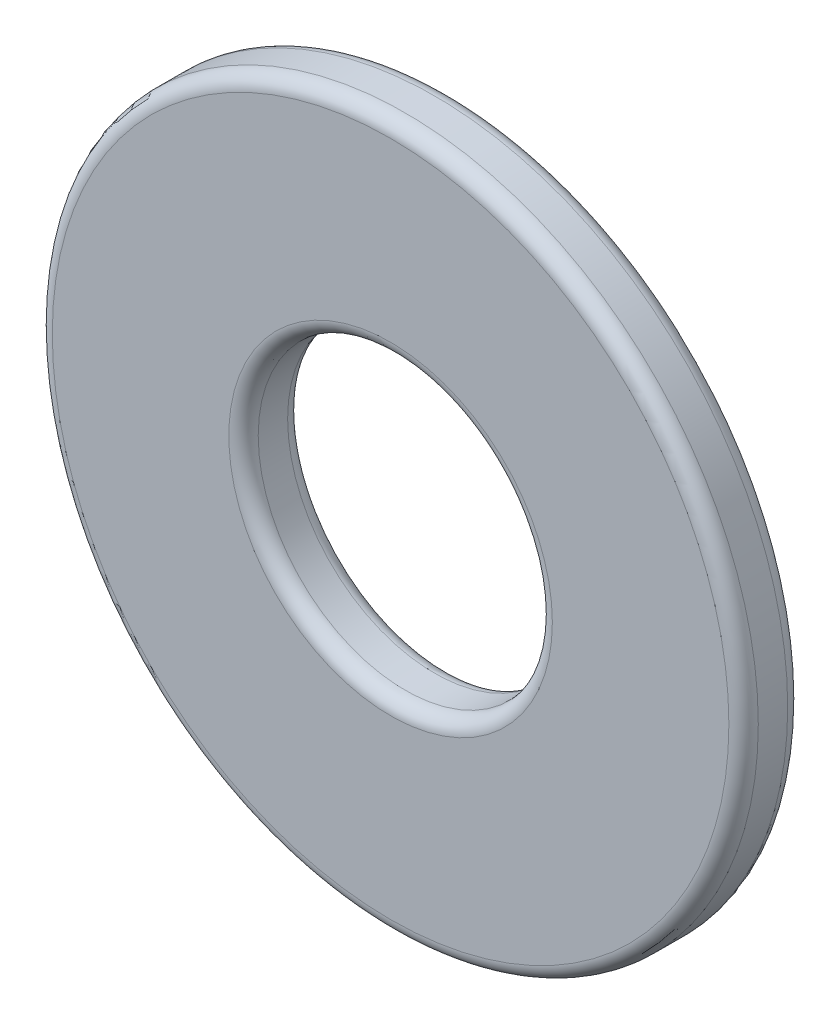
ISO-10303-21;
HEADER;
FILE_DESCRIPTION(('STEP AP214'),'2;1');
FILE_NAME('part.step','',(''),(''),'','','');
FILE_SCHEMA(('AUTOMOTIVE_DESIGN { 1 0 10303 214 1 1 1 1 }'));
ENDSEC;
DATA;
#1=APPLICATION_CONTEXT('core data for automotive mechanical design processes');
#2=APPLICATION_PROTOCOL_DEFINITION('international standard','automotive_design',2000,#1);
#3=PRODUCT_CONTEXT('',#1,'mechanical');
#4=PRODUCT('Part','Part','',(#3));
#5=PRODUCT_RELATED_PRODUCT_CATEGORY('part','',(#4));
#6=PRODUCT_DEFINITION_FORMATION('','',#4);
#7=PRODUCT_DEFINITION_CONTEXT('part definition',#1,'design');
#8=PRODUCT_DEFINITION('design','',#6,#7);
#9=PRODUCT_DEFINITION_SHAPE('','',#8);
#10=(LENGTH_UNIT() NAMED_UNIT(*) SI_UNIT(.MILLI.,.METRE.));
#11=(NAMED_UNIT(*) PLANE_ANGLE_UNIT() SI_UNIT($,.RADIAN.));
#12=(NAMED_UNIT(*) SI_UNIT($,.STERADIAN.) SOLID_ANGLE_UNIT());
#13=UNCERTAINTY_MEASURE_WITH_UNIT(LENGTH_MEASURE(1.E-05),#10,'distance_accuracy_value','');
#14=(GEOMETRIC_REPRESENTATION_CONTEXT(3) GLOBAL_UNCERTAINTY_ASSIGNED_CONTEXT((#13)) GLOBAL_UNIT_ASSIGNED_CONTEXT((#10,
#11,#12)) REPRESENTATION_CONTEXT('',''));
#15=CARTESIAN_POINT('',(0.,0.,0.));
#16=DIRECTION('',(0.,0.,1.));
#17=DIRECTION('',(1.,0.,0.));
#18=AXIS2_PLACEMENT_3D('',#15,#16,#17);
#19=CARTESIAN_POINT('',(0.,0.,0.5));
#20=DIRECTION('',(0.,0.,1.));
#21=DIRECTION('',(1.,0.,0.));
#22=AXIS2_PLACEMENT_3D('',#19,#20,#21);
#23=PLANE('',#22);
#24=CARTESIAN_POINT('',(0.,0.,0.5));
#25=DIRECTION('',(0.,0.,1.));
#26=DIRECTION('',(1.,0.,0.));
#27=AXIS2_PLACEMENT_3D('',#24,#25,#26);
#28=CIRCLE('',#27,2.875);
#29=CARTESIAN_POINT('',(2.875,0.,0.5));
#30=VERTEX_POINT('',#29);
#31=EDGE_CURVE('E50',#30,#30,#28,.T.);
#32=ORIENTED_EDGE('',*,*,#31,.T.);
#33=EDGE_LOOP('',(#32));
#34=FACE_BOUND('',#33,.T.);
#35=CARTESIAN_POINT('',(0.,0.,0.5));
#36=DIRECTION('',(0.,0.,1.));
#37=DIRECTION('',(1.,0.,0.));
#38=AXIS2_PLACEMENT_3D('',#35,#36,#37);
#39=CIRCLE('',#38,1.375);
#40=CARTESIAN_POINT('',(1.375,0.,0.5));
#41=VERTEX_POINT('',#40);
#42=EDGE_CURVE('E55',#41,#41,#39,.F.);
#43=ORIENTED_EDGE('',*,*,#42,.T.);
#44=EDGE_LOOP('',(#43));
#45=FACE_BOUND('',#44,.T.);
#46=ADVANCED_FACE('F37',(#34,#45),#23,.T.);
#47=CARTESIAN_POINT('',(0.,0.,0.));
#48=DIRECTION('',(0.,0.,1.));
#49=DIRECTION('',(1.,0.,0.));
#50=AXIS2_PLACEMENT_3D('',#47,#48,#49);
#51=PLANE('',#50);
#52=CARTESIAN_POINT('',(0.,0.,0.));
#53=DIRECTION('',(0.,0.,1.));
#54=DIRECTION('',(1.,0.,0.));
#55=AXIS2_PLACEMENT_3D('',#52,#53,#54);
#56=CIRCLE('',#55,2.875);
#57=CARTESIAN_POINT('',(2.875,0.,0.));
#58=VERTEX_POINT('',#57);
#59=EDGE_CURVE('E61',#58,#58,#56,.F.);
#60=ORIENTED_EDGE('',*,*,#59,.T.);
#61=EDGE_LOOP('',(#60));
#62=FACE_BOUND('',#61,.T.);
#63=CARTESIAN_POINT('',(0.,0.,0.));
#64=DIRECTION('',(0.,0.,1.));
#65=DIRECTION('',(1.,0.,0.));
#66=AXIS2_PLACEMENT_3D('',#63,#64,#65);
#67=CIRCLE('',#66,1.375);
#68=CARTESIAN_POINT('',(1.375,0.,0.));
#69=VERTEX_POINT('',#68);
#70=EDGE_CURVE('E65',#69,#69,#67,.T.);
#71=ORIENTED_EDGE('',*,*,#70,.T.);
#72=EDGE_LOOP('',(#71));
#73=FACE_BOUND('',#72,.T.);
#74=ADVANCED_FACE('F90',(#62,#73),#51,.F.);
#75=CARTESIAN_POINT('',(0.,0.,0.5));
#76=DIRECTION('',(0.,0.,-1.));
#77=DIRECTION('',(-1.,0.,0.));
#78=AXIS2_PLACEMENT_3D('',#75,#76,#77);
#79=CYLINDRICAL_SURFACE('',#78,3.);
#80=CARTESIAN_POINT('',(0.,0.,0.125));
#81=DIRECTION('',(0.,0.,1.));
#82=DIRECTION('',(1.,0.,0.));
#83=AXIS2_PLACEMENT_3D('',#80,#81,#82);
#84=CIRCLE('',#83,3.);
#85=CARTESIAN_POINT('',(3.,0.,0.125));
#86=VERTEX_POINT('',#85);
#87=EDGE_CURVE('E69',#86,#86,#84,.T.);
#88=ORIENTED_EDGE('',*,*,#87,.T.);
#89=EDGE_LOOP('',(#88));
#90=FACE_BOUND('',#89,.T.);
#91=CARTESIAN_POINT('',(0.,0.,0.375));
#92=DIRECTION('',(0.,0.,1.));
#93=DIRECTION('',(1.,0.,0.));
#94=AXIS2_PLACEMENT_3D('',#91,#92,#93);
#95=CIRCLE('',#94,3.);
#96=CARTESIAN_POINT('',(3.,0.,0.375));
#97=VERTEX_POINT('',#96);
#98=EDGE_CURVE('E73',#97,#97,#95,.F.);
#99=ORIENTED_EDGE('',*,*,#98,.T.);
#100=EDGE_LOOP('',(#99));
#101=FACE_BOUND('',#100,.T.);
#102=ADVANCED_FACE('F78',(#90,#101),#79,.T.);
#103=CARTESIAN_POINT('',(0.,0.,0.5));
#104=DIRECTION('',(0.,0.,-1.));
#105=DIRECTION('',(-1.,0.,0.));
#106=AXIS2_PLACEMENT_3D('',#103,#104,#105);
#107=CYLINDRICAL_SURFACE('',#106,1.25);
#108=CARTESIAN_POINT('',(0.,0.,0.125));
#109=DIRECTION('',(0.,0.,1.));
#110=DIRECTION('',(1.,0.,0.));
#111=AXIS2_PLACEMENT_3D('',#108,#109,#110);
#112=CIRCLE('',#111,1.25);
#113=CARTESIAN_POINT('',(1.25,0.,0.125));
#114=VERTEX_POINT('',#113);
#115=EDGE_CURVE('E10',#114,#114,#112,.F.);
#116=ORIENTED_EDGE('',*,*,#115,.T.);
#117=EDGE_LOOP('',(#116));
#118=FACE_BOUND('',#117,.T.);
#119=CARTESIAN_POINT('',(0.,0.,0.375));
#120=DIRECTION('',(0.,0.,1.));
#121=DIRECTION('',(1.,0.,0.));
#122=AXIS2_PLACEMENT_3D('',#119,#120,#121);
#123=CIRCLE('',#122,1.25);
#124=CARTESIAN_POINT('',(1.25,0.,0.375));
#125=VERTEX_POINT('',#124);
#126=EDGE_CURVE('E45',#125,#125,#123,.T.);
#127=ORIENTED_EDGE('',*,*,#126,.T.);
#128=EDGE_LOOP('',(#127));
#129=FACE_BOUND('',#128,.T.);
#130=ADVANCED_FACE('F106',(#118,#129),#107,.F.);
#131=CARTESIAN_POINT('',(0.,0.,0.125));
#132=DIRECTION('',(0.,0.,1.));
#133=DIRECTION('',(1.,0.,0.));
#134=AXIS2_PLACEMENT_3D('',#131,#132,#133);
#135=TOROIDAL_SURFACE('',#134,2.875,0.125);
#136=ORIENTED_EDGE('',*,*,#59,.F.);
#137=EDGE_LOOP('',(#136));
#138=FACE_BOUND('',#137,.T.);
#139=ORIENTED_EDGE('',*,*,#87,.F.);
#140=EDGE_LOOP('',(#139));
#141=FACE_BOUND('',#140,.T.);
#142=ADVANCED_FACE('F84',(#138,#141),#135,.T.);
#143=CARTESIAN_POINT('',(0.,0.,0.375));
#144=DIRECTION('',(0.,0.,1.));
#145=DIRECTION('',(1.,0.,0.));
#146=AXIS2_PLACEMENT_3D('',#143,#144,#145);
#147=TOROIDAL_SURFACE('',#146,2.875,0.125);
#148=ORIENTED_EDGE('',*,*,#98,.F.);
#149=EDGE_LOOP('',(#148));
#150=FACE_BOUND('',#149,.T.);
#151=ORIENTED_EDGE('',*,*,#31,.F.);
#152=EDGE_LOOP('',(#151));
#153=FACE_BOUND('',#152,.T.);
#154=ADVANCED_FACE('F80',(#150,#153),#147,.T.);
#155=CARTESIAN_POINT('',(0.,0.,0.125));
#156=DIRECTION('',(0.,0.,1.));
#157=DIRECTION('',(1.,0.,0.));
#158=AXIS2_PLACEMENT_3D('',#155,#156,#157);
#159=TOROIDAL_SURFACE('',#158,1.375,0.125);
#160=ORIENTED_EDGE('',*,*,#115,.F.);
#161=EDGE_LOOP('',(#160));
#162=FACE_BOUND('',#161,.T.);
#163=ORIENTED_EDGE('',*,*,#70,.F.);
#164=EDGE_LOOP('',(#163));
#165=FACE_BOUND('',#164,.T.);
#166=ADVANCED_FACE('F83',(#162,#165),#159,.T.);
#167=CARTESIAN_POINT('',(0.,0.,0.375));
#168=DIRECTION('',(0.,0.,1.));
#169=DIRECTION('',(1.,0.,0.));
#170=AXIS2_PLACEMENT_3D('',#167,#168,#169);
#171=TOROIDAL_SURFACE('',#170,1.375,0.125);
#172=ORIENTED_EDGE('',*,*,#42,.F.);
#173=EDGE_LOOP('',(#172));
#174=FACE_BOUND('',#173,.T.);
#175=ORIENTED_EDGE('',*,*,#126,.F.);
#176=EDGE_LOOP('',(#175));
#177=FACE_BOUND('',#176,.T.);
#178=ADVANCED_FACE('F39',(#174,#177),#171,.T.);
#179=CLOSED_SHELL('',(#46,#74,#102,#130,#142,#154,#166,#178));
#180=MANIFOLD_SOLID_BREP('B2',#179);
#181=ADVANCED_BREP_SHAPE_REPRESENTATION('',(#18,#180),#14);
#182=SHAPE_DEFINITION_REPRESENTATION(#9,#181);
ENDSEC;
END-ISO-10303-21;
